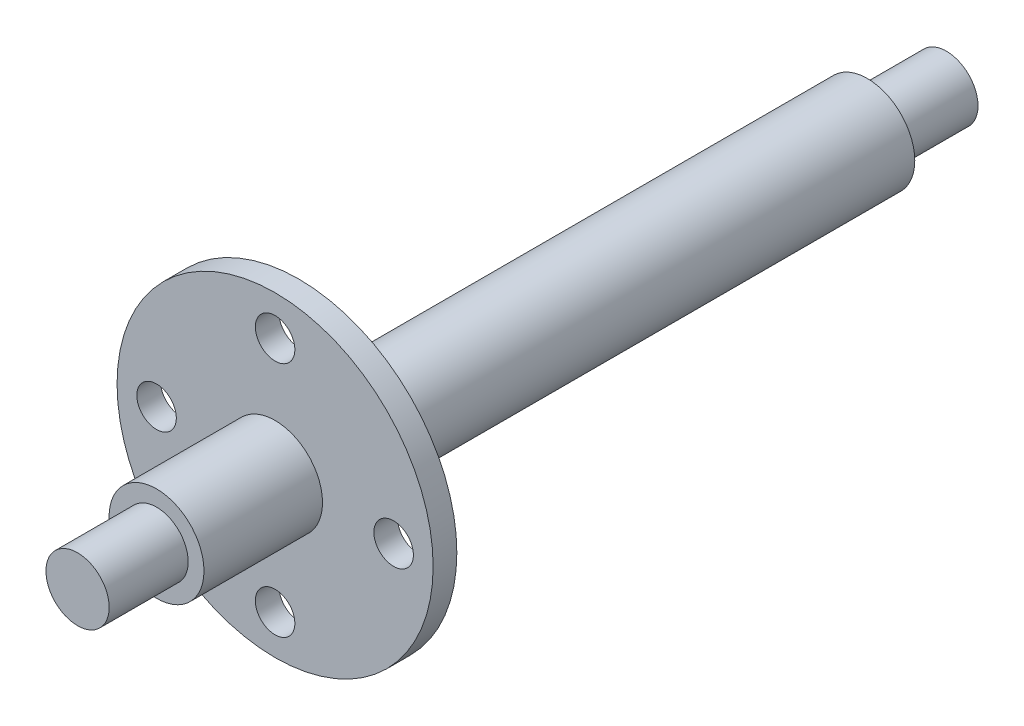
ISO-10303-21;
HEADER;
FILE_DESCRIPTION(('STEP AP214'),'2;1');
FILE_NAME('part.step','',(''),(''),'','','');
FILE_SCHEMA(('AUTOMOTIVE_DESIGN { 1 0 10303 214 1 1 1 1 }'));
ENDSEC;
DATA;
#1=APPLICATION_CONTEXT('core data for automotive mechanical design processes');
#2=APPLICATION_PROTOCOL_DEFINITION('international standard','automotive_design',2000,#1);
#3=PRODUCT_CONTEXT('',#1,'mechanical');
#4=PRODUCT('Part','Part','',(#3));
#5=PRODUCT_RELATED_PRODUCT_CATEGORY('part','',(#4));
#6=PRODUCT_DEFINITION_FORMATION('','',#4);
#7=PRODUCT_DEFINITION_CONTEXT('part definition',#1,'design');
#8=PRODUCT_DEFINITION('design','',#6,#7);
#9=PRODUCT_DEFINITION_SHAPE('','',#8);
#10=(LENGTH_UNIT() NAMED_UNIT(*) SI_UNIT(.MILLI.,.METRE.));
#11=(NAMED_UNIT(*) PLANE_ANGLE_UNIT() SI_UNIT($,.RADIAN.));
#12=(NAMED_UNIT(*) SI_UNIT($,.STERADIAN.) SOLID_ANGLE_UNIT());
#13=UNCERTAINTY_MEASURE_WITH_UNIT(LENGTH_MEASURE(1.E-05),#10,'distance_accuracy_value','');
#14=(GEOMETRIC_REPRESENTATION_CONTEXT(3) GLOBAL_UNCERTAINTY_ASSIGNED_CONTEXT((#13)) GLOBAL_UNIT_ASSIGNED_CONTEXT((#10,
#11,#12)) REPRESENTATION_CONTEXT('',''));
#15=CARTESIAN_POINT('',(0.,0.,0.));
#16=DIRECTION('',(0.,0.,1.));
#17=DIRECTION('',(1.,0.,0.));
#18=AXIS2_PLACEMENT_3D('',#15,#16,#17);
#19=CARTESIAN_POINT('',(0.,0.,109.95));
#20=DIRECTION('',(0.,0.,-1.));
#21=DIRECTION('',(-1.,0.,0.));
#22=AXIS2_PLACEMENT_3D('',#19,#20,#21);
#23=CYLINDRICAL_SURFACE('',#22,6.);
#24=CARTESIAN_POINT('',(0.,0.,81.95));
#25=DIRECTION('',(0.,0.,1.));
#26=DIRECTION('',(1.,0.,0.));
#27=AXIS2_PLACEMENT_3D('',#24,#25,#26);
#28=CIRCLE('',#27,6.);
#29=CARTESIAN_POINT('',(6.,0.,81.95));
#30=VERTEX_POINT('',#29);
#31=EDGE_CURVE('E10',#30,#30,#28,.T.);
#32=ORIENTED_EDGE('',*,*,#31,.F.);
#33=EDGE_LOOP('',(#32));
#34=FACE_BOUND('',#33,.T.);
#35=CARTESIAN_POINT('',(0.,0.,10.));
#36=DIRECTION('',(0.,0.,1.));
#37=DIRECTION('',(1.,0.,0.));
#38=AXIS2_PLACEMENT_3D('',#35,#36,#37);
#39=CIRCLE('',#38,6.);
#40=CARTESIAN_POINT('',(6.,0.,10.));
#41=VERTEX_POINT('',#40);
#42=EDGE_CURVE('E104',#41,#41,#39,.T.);
#43=ORIENTED_EDGE('',*,*,#42,.T.);
#44=EDGE_LOOP('',(#43));
#45=FACE_BOUND('',#44,.T.);
#46=ADVANCED_FACE('F41',(#34,#45),#23,.T.);
#47=CARTESIAN_POINT('',(0.,0.,84.95));
#48=DIRECTION('',(0.,0.,1.));
#49=DIRECTION('',(1.,0.,0.));
#50=AXIS2_PLACEMENT_3D('',#47,#48,#49);
#51=CIRCLE('',#50,6.);
#52=CARTESIAN_POINT('',(6.,0.,84.95));
#53=VERTEX_POINT('',#52);
#54=EDGE_CURVE('E45',#53,#53,#51,.T.);
#55=ORIENTED_EDGE('',*,*,#54,.T.);
#56=EDGE_LOOP('',(#55));
#57=FACE_BOUND('',#56,.T.);
#58=CARTESIAN_POINT('',(0.,0.,99.95));
#59=DIRECTION('',(0.,0.,1.));
#60=DIRECTION('',(1.,0.,0.));
#61=AXIS2_PLACEMENT_3D('',#58,#59,#60);
#62=CIRCLE('',#61,6.);
#63=CARTESIAN_POINT('',(6.,0.,99.95));
#64=VERTEX_POINT('',#63);
#65=EDGE_CURVE('E92',#64,#64,#62,.T.);
#66=ORIENTED_EDGE('',*,*,#65,.F.);
#67=EDGE_LOOP('',(#66));
#68=FACE_BOUND('',#67,.T.);
#69=ADVANCED_FACE('F43',(#57,#68),#23,.T.);
#70=CARTESIAN_POINT('',(0.,0.,84.95));
#71=DIRECTION('',(0.,0.,1.));
#72=DIRECTION('',(1.,0.,0.));
#73=AXIS2_PLACEMENT_3D('',#70,#71,#72);
#74=PLANE('',#73);
#75=ORIENTED_EDGE('',*,*,#54,.F.);
#76=EDGE_LOOP('',(#75));
#77=FACE_BOUND('',#76,.T.);
#78=CARTESIAN_POINT('',(8.47140372315957E-13,-15.,84.95));
#79=DIRECTION('',(0.,0.,1.));
#80=DIRECTION('',(1.,0.,0.));
#81=AXIS2_PLACEMENT_3D('',#78,#79,#80);
#82=CIRCLE('',#81,2.50000000000091);
#83=CARTESIAN_POINT('',(2.50000000000176,-15.,84.95));
#84=VERTEX_POINT('',#83);
#85=EDGE_CURVE('E76',#84,#84,#82,.T.);
#86=ORIENTED_EDGE('',*,*,#85,.F.);
#87=EDGE_LOOP('',(#86));
#88=FACE_BOUND('',#87,.T.);
#89=CARTESIAN_POINT('',(0.,15.,84.95));
#90=DIRECTION('',(0.,0.,1.));
#91=DIRECTION('',(1.,0.,0.));
#92=AXIS2_PLACEMENT_3D('',#89,#90,#91);
#93=CIRCLE('',#92,2.5);
#94=CARTESIAN_POINT('',(2.5,15.,84.95));
#95=VERTEX_POINT('',#94);
#96=EDGE_CURVE('E60',#95,#95,#93,.T.);
#97=ORIENTED_EDGE('',*,*,#96,.F.);
#98=EDGE_LOOP('',(#97));
#99=FACE_BOUND('',#98,.T.);
#100=CARTESIAN_POINT('',(0.,0.,84.95));
#101=DIRECTION('',(0.,0.,1.));
#102=DIRECTION('',(1.,0.,0.));
#103=AXIS2_PLACEMENT_3D('',#100,#101,#102);
#104=CIRCLE('',#103,20.);
#105=CARTESIAN_POINT('',(20.,0.,84.95));
#106=VERTEX_POINT('',#105);
#107=EDGE_CURVE('E54',#106,#106,#104,.T.);
#108=ORIENTED_EDGE('',*,*,#107,.T.);
#109=EDGE_LOOP('',(#108));
#110=FACE_BOUND('',#109,.T.);
#111=CARTESIAN_POINT('',(15.0000000000004,4.23570186157979E-13,84.95));
#112=DIRECTION('',(0.,0.,1.));
#113=DIRECTION('',(1.,0.,0.));
#114=AXIS2_PLACEMENT_3D('',#111,#112,#113);
#115=CIRCLE('',#114,2.50000000000033);
#116=CARTESIAN_POINT('',(17.5000000000008,4.23570186157979E-13,84.95));
#117=VERTEX_POINT('',#116);
#118=EDGE_CURVE('E68',#117,#117,#115,.T.);
#119=ORIENTED_EDGE('',*,*,#118,.F.);
#120=EDGE_LOOP('',(#119));
#121=FACE_BOUND('',#120,.T.);
#122=CARTESIAN_POINT('',(-14.9999999999996,-4.254071563567E-13,84.95));
#123=DIRECTION('',(0.,0.,1.));
#124=DIRECTION('',(1.,0.,0.));
#125=AXIS2_PLACEMENT_3D('',#122,#123,#124);
#126=CIRCLE('',#125,2.50000000000068);
#127=CARTESIAN_POINT('',(-12.4999999999989,-4.254071563567E-13,84.95));
#128=VERTEX_POINT('',#127);
#129=EDGE_CURVE('E84',#128,#128,#126,.T.);
#130=ORIENTED_EDGE('',*,*,#129,.F.);
#131=EDGE_LOOP('',(#130));
#132=FACE_BOUND('',#131,.T.);
#133=ADVANCED_FACE('F138',(#77,#88,#99,#110,#121,#132),#74,.T.);
#134=CARTESIAN_POINT('',(0.,0.,81.95));
#135=DIRECTION('',(0.,0.,1.));
#136=DIRECTION('',(1.,0.,0.));
#137=AXIS2_PLACEMENT_3D('',#134,#135,#136);
#138=PLANE('',#137);
#139=ORIENTED_EDGE('',*,*,#31,.T.);
#140=EDGE_LOOP('',(#139));
#141=FACE_BOUND('',#140,.T.);
#142=CARTESIAN_POINT('',(0.,0.,81.95));
#143=DIRECTION('',(0.,0.,1.));
#144=DIRECTION('',(1.,0.,0.));
#145=AXIS2_PLACEMENT_3D('',#142,#143,#144);
#146=CIRCLE('',#145,20.);
#147=CARTESIAN_POINT('',(20.,0.,81.95));
#148=VERTEX_POINT('',#147);
#149=EDGE_CURVE('E56',#148,#148,#146,.T.);
#150=ORIENTED_EDGE('',*,*,#149,.F.);
#151=EDGE_LOOP('',(#150));
#152=FACE_BOUND('',#151,.T.);
#153=CARTESIAN_POINT('',(0.,15.,81.95));
#154=DIRECTION('',(0.,0.,1.));
#155=DIRECTION('',(1.,0.,0.));
#156=AXIS2_PLACEMENT_3D('',#153,#154,#155);
#157=CIRCLE('',#156,2.5);
#158=CARTESIAN_POINT('',(2.5,15.,81.95));
#159=VERTEX_POINT('',#158);
#160=EDGE_CURVE('E64',#159,#159,#157,.T.);
#161=ORIENTED_EDGE('',*,*,#160,.T.);
#162=EDGE_LOOP('',(#161));
#163=FACE_BOUND('',#162,.T.);
#164=CARTESIAN_POINT('',(15.0000000000004,4.23570186157979E-13,81.95));
#165=DIRECTION('',(0.,0.,1.));
#166=DIRECTION('',(1.,0.,0.));
#167=AXIS2_PLACEMENT_3D('',#164,#165,#166);
#168=CIRCLE('',#167,2.50000000000033);
#169=CARTESIAN_POINT('',(17.5000000000008,4.23570186157979E-13,81.95));
#170=VERTEX_POINT('',#169);
#171=EDGE_CURVE('E72',#170,#170,#168,.T.);
#172=ORIENTED_EDGE('',*,*,#171,.T.);
#173=EDGE_LOOP('',(#172));
#174=FACE_BOUND('',#173,.T.);
#175=CARTESIAN_POINT('',(8.47140372315957E-13,-15.,81.95));
#176=DIRECTION('',(0.,0.,1.));
#177=DIRECTION('',(1.,0.,0.));
#178=AXIS2_PLACEMENT_3D('',#175,#176,#177);
#179=CIRCLE('',#178,2.50000000000091);
#180=CARTESIAN_POINT('',(2.50000000000176,-15.,81.95));
#181=VERTEX_POINT('',#180);
#182=EDGE_CURVE('E80',#181,#181,#179,.T.);
#183=ORIENTED_EDGE('',*,*,#182,.T.);
#184=EDGE_LOOP('',(#183));
#185=FACE_BOUND('',#184,.T.);
#186=CARTESIAN_POINT('',(-14.9999999999996,-4.254071563567E-13,81.95));
#187=DIRECTION('',(0.,0.,1.));
#188=DIRECTION('',(1.,0.,0.));
#189=AXIS2_PLACEMENT_3D('',#186,#187,#188);
#190=CIRCLE('',#189,2.50000000000068);
#191=CARTESIAN_POINT('',(-12.4999999999989,-4.254071563567E-13,81.95));
#192=VERTEX_POINT('',#191);
#193=EDGE_CURVE('E88',#192,#192,#190,.T.);
#194=ORIENTED_EDGE('',*,*,#193,.T.);
#195=EDGE_LOOP('',(#194));
#196=FACE_BOUND('',#195,.T.);
#197=ADVANCED_FACE('F178',(#141,#152,#163,#174,#185,#196),#138,.F.);
#198=CARTESIAN_POINT('',(0.,0.,84.95));
#199=DIRECTION('',(0.,0.,-1.));
#200=DIRECTION('',(-1.,0.,0.));
#201=AXIS2_PLACEMENT_3D('',#198,#199,#200);
#202=CYLINDRICAL_SURFACE('',#201,20.);
#203=ORIENTED_EDGE('',*,*,#107,.F.);
#204=EDGE_LOOP('',(#203));
#205=FACE_BOUND('',#204,.T.);
#206=ORIENTED_EDGE('',*,*,#149,.T.);
#207=EDGE_LOOP('',(#206));
#208=FACE_BOUND('',#207,.T.);
#209=ADVANCED_FACE('F174',(#205,#208),#202,.T.);
#210=CARTESIAN_POINT('',(0.,15.,84.95));
#211=DIRECTION('',(0.,0.,-1.));
#212=DIRECTION('',(-1.,0.,0.));
#213=AXIS2_PLACEMENT_3D('',#210,#211,#212);
#214=CYLINDRICAL_SURFACE('',#213,2.5);
#215=ORIENTED_EDGE('',*,*,#96,.T.);
#216=EDGE_LOOP('',(#215));
#217=FACE_BOUND('',#216,.T.);
#218=ORIENTED_EDGE('',*,*,#160,.F.);
#219=EDGE_LOOP('',(#218));
#220=FACE_BOUND('',#219,.T.);
#221=ADVANCED_FACE('F170',(#217,#220),#214,.F.);
#222=CARTESIAN_POINT('',(15.0000000000004,4.23570186157979E-13,84.95));
#223=DIRECTION('',(0.,0.,-1.));
#224=DIRECTION('',(-1.,0.,0.));
#225=AXIS2_PLACEMENT_3D('',#222,#223,#224);
#226=CYLINDRICAL_SURFACE('',#225,2.50000000000033);
#227=ORIENTED_EDGE('',*,*,#118,.T.);
#228=EDGE_LOOP('',(#227));
#229=FACE_BOUND('',#228,.T.);
#230=ORIENTED_EDGE('',*,*,#171,.F.);
#231=EDGE_LOOP('',(#230));
#232=FACE_BOUND('',#231,.T.);
#233=ADVANCED_FACE('F166',(#229,#232),#226,.F.);
#234=CARTESIAN_POINT('',(8.47140372315957E-13,-15.,84.95));
#235=DIRECTION('',(0.,0.,-1.));
#236=DIRECTION('',(-1.,0.,0.));
#237=AXIS2_PLACEMENT_3D('',#234,#235,#236);
#238=CYLINDRICAL_SURFACE('',#237,2.50000000000091);
#239=ORIENTED_EDGE('',*,*,#85,.T.);
#240=EDGE_LOOP('',(#239));
#241=FACE_BOUND('',#240,.T.);
#242=ORIENTED_EDGE('',*,*,#182,.F.);
#243=EDGE_LOOP('',(#242));
#244=FACE_BOUND('',#243,.T.);
#245=ADVANCED_FACE('F162',(#241,#244),#238,.F.);
#246=CARTESIAN_POINT('',(-14.9999999999996,-4.254071563567E-13,84.95));
#247=DIRECTION('',(0.,0.,-1.));
#248=DIRECTION('',(-1.,0.,0.));
#249=AXIS2_PLACEMENT_3D('',#246,#247,#248);
#250=CYLINDRICAL_SURFACE('',#249,2.50000000000068);
#251=ORIENTED_EDGE('',*,*,#129,.T.);
#252=EDGE_LOOP('',(#251));
#253=FACE_BOUND('',#252,.T.);
#254=ORIENTED_EDGE('',*,*,#193,.F.);
#255=EDGE_LOOP('',(#254));
#256=FACE_BOUND('',#255,.T.);
#257=ADVANCED_FACE('F158',(#253,#256),#250,.F.);
#258=CARTESIAN_POINT('',(0.,0.,99.95));
#259=DIRECTION('',(0.,0.,1.));
#260=DIRECTION('',(1.,0.,0.));
#261=AXIS2_PLACEMENT_3D('',#258,#259,#260);
#262=PLANE('',#261);
#263=CARTESIAN_POINT('',(0.,0.,99.95));
#264=DIRECTION('',(0.,0.,1.));
#265=DIRECTION('',(1.,0.,0.));
#266=AXIS2_PLACEMENT_3D('',#263,#264,#265);
#267=CIRCLE('',#266,4.);
#268=CARTESIAN_POINT('',(4.,0.,99.95));
#269=VERTEX_POINT('',#268);
#270=EDGE_CURVE('E99',#269,#269,#267,.T.);
#271=ORIENTED_EDGE('',*,*,#270,.F.);
#272=EDGE_LOOP('',(#271));
#273=FACE_BOUND('',#272,.T.);
#274=ORIENTED_EDGE('',*,*,#65,.T.);
#275=EDGE_LOOP('',(#274));
#276=FACE_BOUND('',#275,.T.);
#277=ADVANCED_FACE('F154',(#273,#276),#262,.T.);
#278=CARTESIAN_POINT('',(0.,0.,99.95));
#279=DIRECTION('',(0.,0.,1.));
#280=DIRECTION('',(1.,0.,0.));
#281=AXIS2_PLACEMENT_3D('',#278,#279,#280);
#282=CYLINDRICAL_SURFACE('',#281,4.);
#283=ORIENTED_EDGE('',*,*,#270,.T.);
#284=EDGE_LOOP('',(#283));
#285=FACE_BOUND('',#284,.T.);
#286=CARTESIAN_POINT('',(0.,0.,109.95));
#287=DIRECTION('',(0.,0.,1.));
#288=DIRECTION('',(1.,0.,0.));
#289=AXIS2_PLACEMENT_3D('',#286,#287,#288);
#290=CIRCLE('',#289,4.);
#291=CARTESIAN_POINT('',(4.,0.,109.95));
#292=VERTEX_POINT('',#291);
#293=EDGE_CURVE('E100',#292,#292,#290,.T.);
#294=ORIENTED_EDGE('',*,*,#293,.F.);
#295=EDGE_LOOP('',(#294));
#296=FACE_BOUND('',#295,.T.);
#297=ADVANCED_FACE('F149',(#285,#296),#282,.T.);
#298=CARTESIAN_POINT('',(0.,0.,109.95));
#299=DIRECTION('',(0.,0.,1.));
#300=DIRECTION('',(1.,0.,0.));
#301=AXIS2_PLACEMENT_3D('',#298,#299,#300);
#302=PLANE('',#301);
#303=ORIENTED_EDGE('',*,*,#293,.T.);
#304=EDGE_LOOP('',(#303));
#305=FACE_BOUND('',#304,.T.);
#306=ADVANCED_FACE('F144',(#305),#302,.T.);
#307=CARTESIAN_POINT('',(0.,0.,10.));
#308=DIRECTION('',(0.,0.,-1.));
#309=DIRECTION('',(1.,0.,0.));
#310=AXIS2_PLACEMENT_3D('',#307,#308,#309);
#311=PLANE('',#310);
#312=ORIENTED_EDGE('',*,*,#42,.F.);
#313=EDGE_LOOP('',(#312));
#314=FACE_BOUND('',#313,.T.);
#315=CARTESIAN_POINT('',(0.,0.,10.));
#316=DIRECTION('',(0.,0.,1.));
#317=DIRECTION('',(1.,0.,0.));
#318=AXIS2_PLACEMENT_3D('',#315,#316,#317);
#319=CIRCLE('',#318,4.);
#320=CARTESIAN_POINT('',(4.,0.,10.));
#321=VERTEX_POINT('',#320);
#322=EDGE_CURVE('E111',#321,#321,#319,.T.);
#323=ORIENTED_EDGE('',*,*,#322,.T.);
#324=EDGE_LOOP('',(#323));
#325=FACE_BOUND('',#324,.T.);
#326=ADVANCED_FACE('F120',(#314,#325),#311,.T.);
#327=CARTESIAN_POINT('',(0.,0.,10.));
#328=DIRECTION('',(0.,0.,-1.));
#329=DIRECTION('',(-1.,0.,0.));
#330=AXIS2_PLACEMENT_3D('',#327,#328,#329);
#331=CYLINDRICAL_SURFACE('',#330,4.);
#332=ORIENTED_EDGE('',*,*,#322,.F.);
#333=EDGE_LOOP('',(#332));
#334=FACE_BOUND('',#333,.T.);
#335=CARTESIAN_POINT('',(0.,0.,0.));
#336=DIRECTION('',(0.,0.,1.));
#337=DIRECTION('',(1.,0.,0.));
#338=AXIS2_PLACEMENT_3D('',#335,#336,#337);
#339=CIRCLE('',#338,4.);
#340=CARTESIAN_POINT('',(4.,0.,0.));
#341=VERTEX_POINT('',#340);
#342=EDGE_CURVE('E112',#341,#341,#339,.T.);
#343=ORIENTED_EDGE('',*,*,#342,.T.);
#344=EDGE_LOOP('',(#343));
#345=FACE_BOUND('',#344,.T.);
#346=ADVANCED_FACE('F122',(#334,#345),#331,.T.);
#347=CARTESIAN_POINT('',(0.,0.,0.));
#348=DIRECTION('',(0.,0.,1.));
#349=DIRECTION('',(1.,0.,0.));
#350=AXIS2_PLACEMENT_3D('',#347,#348,#349);
#351=PLANE('',#350);
#352=ORIENTED_EDGE('',*,*,#342,.F.);
#353=EDGE_LOOP('',(#352));
#354=FACE_BOUND('',#353,.T.);
#355=ADVANCED_FACE('F125',(#354),#351,.F.);
#356=CLOSED_SHELL('',(#46,#69,#133,#197,#209,#221,#233,#245,#257,#277,#297,#306,#326,#346,#355));
#357=MANIFOLD_SOLID_BREP('B2',#356);
#358=ADVANCED_BREP_SHAPE_REPRESENTATION('',(#18,#357),#14);
#359=SHAPE_DEFINITION_REPRESENTATION(#9,#358);
ENDSEC;
END-ISO-10303-21;
